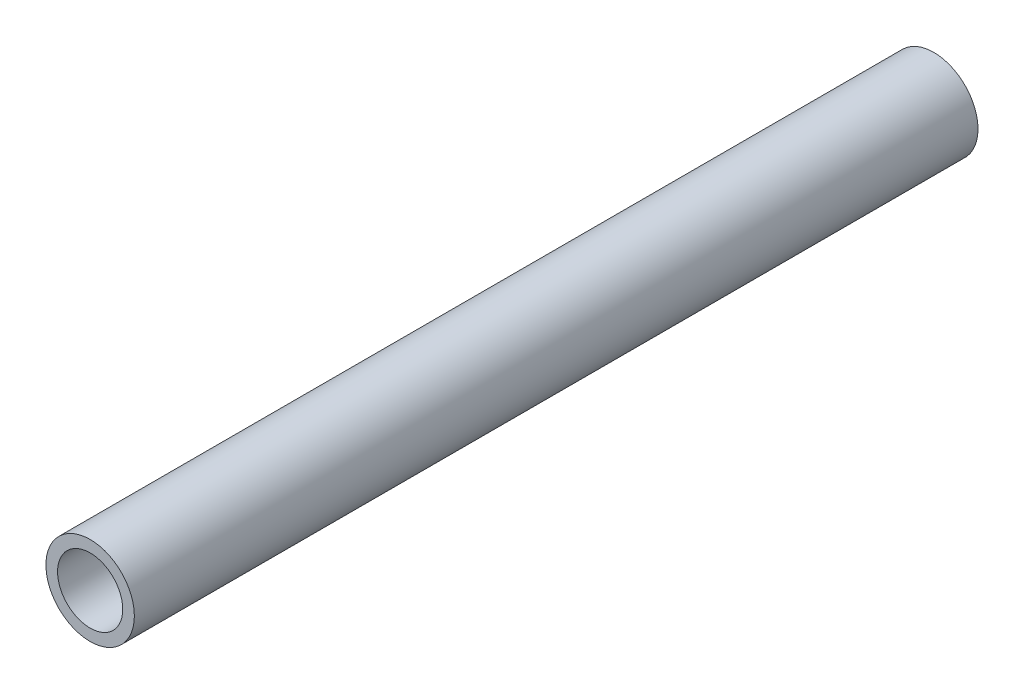
ISO-10303-21;
HEADER;
FILE_DESCRIPTION(('STEP AP214'),'2;1');
FILE_NAME('part.step','',(''),(''),'','','');
FILE_SCHEMA(('AUTOMOTIVE_DESIGN { 1 0 10303 214 1 1 1 1 }'));
ENDSEC;
DATA;
#1=APPLICATION_CONTEXT('core data for automotive mechanical design processes');
#2=APPLICATION_PROTOCOL_DEFINITION('international standard','automotive_design',2000,#1);
#3=PRODUCT_CONTEXT('',#1,'mechanical');
#4=PRODUCT('Part','Part','',(#3));
#5=PRODUCT_RELATED_PRODUCT_CATEGORY('part','',(#4));
#6=PRODUCT_DEFINITION_FORMATION('','',#4);
#7=PRODUCT_DEFINITION_CONTEXT('part definition',#1,'design');
#8=PRODUCT_DEFINITION('design','',#6,#7);
#9=PRODUCT_DEFINITION_SHAPE('','',#8);
#10=(LENGTH_UNIT() NAMED_UNIT(*) SI_UNIT(.MILLI.,.METRE.));
#11=(NAMED_UNIT(*) PLANE_ANGLE_UNIT() SI_UNIT($,.RADIAN.));
#12=(NAMED_UNIT(*) SI_UNIT($,.STERADIAN.) SOLID_ANGLE_UNIT());
#13=UNCERTAINTY_MEASURE_WITH_UNIT(LENGTH_MEASURE(1.E-05),#10,'distance_accuracy_value','');
#14=(GEOMETRIC_REPRESENTATION_CONTEXT(3) GLOBAL_UNCERTAINTY_ASSIGNED_CONTEXT((#13)) GLOBAL_UNIT_ASSIGNED_CONTEXT((#10,
#11,#12)) REPRESENTATION_CONTEXT('',''));
#15=CARTESIAN_POINT('',(0.,0.,0.));
#16=DIRECTION('',(0.,0.,1.));
#17=DIRECTION('',(1.,0.,0.));
#18=AXIS2_PLACEMENT_3D('',#15,#16,#17);
#19=CARTESIAN_POINT('',(0.,0.,92.075));
#20=DIRECTION('',(0.,0.,1.));
#21=DIRECTION('',(1.,0.,0.));
#22=AXIS2_PLACEMENT_3D('',#19,#20,#21);
#23=PLANE('',#22);
#24=CARTESIAN_POINT('',(0.,0.,92.075));
#25=DIRECTION('',(0.,0.,1.));
#26=DIRECTION('',(1.,0.,0.));
#27=AXIS2_PLACEMENT_3D('',#24,#25,#26);
#28=CIRCLE('',#27,4.826);
#29=CARTESIAN_POINT('',(4.826,0.,92.075));
#30=VERTEX_POINT('',#29);
#31=EDGE_CURVE('E10',#30,#30,#28,.T.);
#32=ORIENTED_EDGE('',*,*,#31,.T.);
#33=EDGE_LOOP('',(#32));
#34=FACE_BOUND('',#33,.T.);
#35=CARTESIAN_POINT('',(0.,0.,92.075));
#36=DIRECTION('',(0.,0.,1.));
#37=DIRECTION('',(1.,0.,0.));
#38=AXIS2_PLACEMENT_3D('',#35,#36,#37);
#39=CIRCLE('',#38,3.556);
#40=CARTESIAN_POINT('',(3.556,0.,92.075));
#41=VERTEX_POINT('',#40);
#42=EDGE_CURVE('E41',#41,#41,#39,.T.);
#43=ORIENTED_EDGE('',*,*,#42,.F.);
#44=EDGE_LOOP('',(#43));
#45=FACE_BOUND('',#44,.T.);
#46=ADVANCED_FACE('F30',(#34,#45),#23,.T.);
#47=CARTESIAN_POINT('',(0.,0.,0.));
#48=DIRECTION('',(0.,0.,1.));
#49=DIRECTION('',(1.,0.,0.));
#50=AXIS2_PLACEMENT_3D('',#47,#48,#49);
#51=PLANE('',#50);
#52=CARTESIAN_POINT('',(0.,0.,0.));
#53=DIRECTION('',(0.,0.,1.));
#54=DIRECTION('',(1.,0.,0.));
#55=AXIS2_PLACEMENT_3D('',#52,#53,#54);
#56=CIRCLE('',#55,4.826);
#57=CARTESIAN_POINT('',(4.826,0.,0.));
#58=VERTEX_POINT('',#57);
#59=EDGE_CURVE('E34',#58,#58,#56,.T.);
#60=ORIENTED_EDGE('',*,*,#59,.F.);
#61=EDGE_LOOP('',(#60));
#62=FACE_BOUND('',#61,.T.);
#63=CARTESIAN_POINT('',(0.,0.,0.));
#64=DIRECTION('',(0.,0.,1.));
#65=DIRECTION('',(1.,0.,0.));
#66=AXIS2_PLACEMENT_3D('',#63,#64,#65);
#67=CIRCLE('',#66,3.556);
#68=CARTESIAN_POINT('',(3.556,0.,0.));
#69=VERTEX_POINT('',#68);
#70=EDGE_CURVE('E43',#69,#69,#67,.T.);
#71=ORIENTED_EDGE('',*,*,#70,.T.);
#72=EDGE_LOOP('',(#71));
#73=FACE_BOUND('',#72,.T.);
#74=ADVANCED_FACE('F53',(#62,#73),#51,.F.);
#75=CARTESIAN_POINT('',(0.,0.,92.075));
#76=DIRECTION('',(0.,0.,-1.));
#77=DIRECTION('',(-1.,0.,0.));
#78=AXIS2_PLACEMENT_3D('',#75,#76,#77);
#79=CYLINDRICAL_SURFACE('',#78,4.826);
#80=ORIENTED_EDGE('',*,*,#31,.F.);
#81=EDGE_LOOP('',(#80));
#82=FACE_BOUND('',#81,.T.);
#83=ORIENTED_EDGE('',*,*,#59,.T.);
#84=EDGE_LOOP('',(#83));
#85=FACE_BOUND('',#84,.T.);
#86=ADVANCED_FACE('F32',(#82,#85),#79,.T.);
#87=CARTESIAN_POINT('',(0.,0.,92.075));
#88=DIRECTION('',(0.,0.,-1.));
#89=DIRECTION('',(-1.,0.,0.));
#90=AXIS2_PLACEMENT_3D('',#87,#88,#89);
#91=CYLINDRICAL_SURFACE('',#90,3.556);
#92=ORIENTED_EDGE('',*,*,#42,.T.);
#93=EDGE_LOOP('',(#92));
#94=FACE_BOUND('',#93,.T.);
#95=ORIENTED_EDGE('',*,*,#70,.F.);
#96=EDGE_LOOP('',(#95));
#97=FACE_BOUND('',#96,.T.);
#98=ADVANCED_FACE('F49',(#94,#97),#91,.F.);
#99=CLOSED_SHELL('',(#46,#74,#86,#98));
#100=MANIFOLD_SOLID_BREP('B2',#99);
#101=ADVANCED_BREP_SHAPE_REPRESENTATION('',(#18,#100),#14);
#102=SHAPE_DEFINITION_REPRESENTATION(#9,#101);
ENDSEC;
END-ISO-10303-21;
